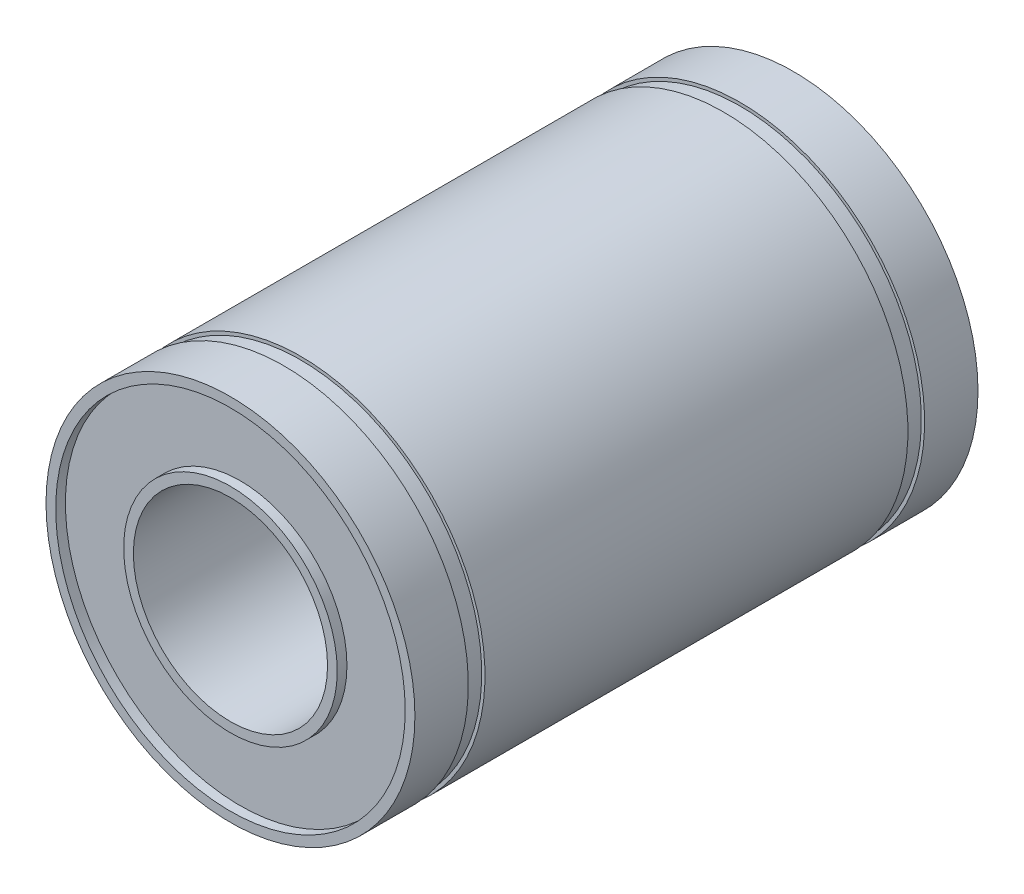
ISO-10303-21;
HEADER;
FILE_DESCRIPTION(('STEP AP214'),'2;1');
FILE_NAME('part.step','',(''),(''),'','','');
FILE_SCHEMA(('AUTOMOTIVE_DESIGN { 1 0 10303 214 1 1 1 1 }'));
ENDSEC;
DATA;
#1=APPLICATION_CONTEXT('core data for automotive mechanical design processes');
#2=APPLICATION_PROTOCOL_DEFINITION('international standard','automotive_design',2000,#1);
#3=PRODUCT_CONTEXT('',#1,'mechanical');
#4=PRODUCT('Part','Part','',(#3));
#5=PRODUCT_RELATED_PRODUCT_CATEGORY('part','',(#4));
#6=PRODUCT_DEFINITION_FORMATION('','',#4);
#7=PRODUCT_DEFINITION_CONTEXT('part definition',#1,'design');
#8=PRODUCT_DEFINITION('design','',#6,#7);
#9=PRODUCT_DEFINITION_SHAPE('','',#8);
#10=(LENGTH_UNIT() NAMED_UNIT(*) SI_UNIT(.MILLI.,.METRE.));
#11=(NAMED_UNIT(*) PLANE_ANGLE_UNIT() SI_UNIT($,.RADIAN.));
#12=(NAMED_UNIT(*) SI_UNIT($,.STERADIAN.) SOLID_ANGLE_UNIT());
#13=UNCERTAINTY_MEASURE_WITH_UNIT(LENGTH_MEASURE(1.E-05),#10,'distance_accuracy_value','');
#14=(GEOMETRIC_REPRESENTATION_CONTEXT(3) GLOBAL_UNCERTAINTY_ASSIGNED_CONTEXT((#13)) GLOBAL_UNIT_ASSIGNED_CONTEXT((#10,
#11,#12)) REPRESENTATION_CONTEXT('',''));
#15=CARTESIAN_POINT('',(0.,0.,0.));
#16=DIRECTION('',(0.,0.,1.));
#17=DIRECTION('',(1.,0.,0.));
#18=AXIS2_PLACEMENT_3D('',#15,#16,#17);
#19=CARTESIAN_POINT('',(0.,0.,-14.5));
#20=DIRECTION('',(0.,0.,1.));
#21=DIRECTION('',(1.,0.,0.));
#22=AXIS2_PLACEMENT_3D('',#19,#20,#21);
#23=PLANE('',#22);
#24=CARTESIAN_POINT('',(0.,0.,-14.5));
#25=DIRECTION('',(0.,0.,1.));
#26=DIRECTION('',(1.,0.,0.));
#27=AXIS2_PLACEMENT_3D('',#24,#25,#26);
#28=CIRCLE('',#27,5.);
#29=CARTESIAN_POINT('',(5.,0.,-14.5));
#30=VERTEX_POINT('',#29);
#31=EDGE_CURVE('E45',#30,#30,#28,.T.);
#32=ORIENTED_EDGE('',*,*,#31,.T.);
#33=EDGE_LOOP('',(#32));
#34=FACE_BOUND('',#33,.T.);
#35=CARTESIAN_POINT('',(0.,0.,-14.5));
#36=DIRECTION('',(0.,0.,1.));
#37=DIRECTION('',(1.,0.,0.));
#38=AXIS2_PLACEMENT_3D('',#35,#36,#37);
#39=CIRCLE('',#38,5.5);
#40=CARTESIAN_POINT('',(5.5,0.,-14.5));
#41=VERTEX_POINT('',#40);
#42=EDGE_CURVE('E91',#41,#41,#39,.T.);
#43=ORIENTED_EDGE('',*,*,#42,.F.);
#44=EDGE_LOOP('',(#43));
#45=FACE_BOUND('',#44,.T.);
#46=ADVANCED_FACE('F32',(#34,#45),#23,.F.);
#47=CARTESIAN_POINT('',(0.,0.,14.5));
#48=DIRECTION('',(0.,0.,1.));
#49=DIRECTION('',(1.,0.,0.));
#50=AXIS2_PLACEMENT_3D('',#47,#48,#49);
#51=PLANE('',#50);
#52=CARTESIAN_POINT('',(0.,0.,14.5));
#53=DIRECTION('',(0.,0.,1.));
#54=DIRECTION('',(1.,0.,0.));
#55=AXIS2_PLACEMENT_3D('',#52,#53,#54);
#56=CIRCLE('',#55,5.);
#57=CARTESIAN_POINT('',(5.,0.,14.5));
#58=VERTEX_POINT('',#57);
#59=EDGE_CURVE('E43',#58,#58,#56,.T.);
#60=ORIENTED_EDGE('',*,*,#59,.F.);
#61=EDGE_LOOP('',(#60));
#62=FACE_BOUND('',#61,.T.);
#63=CARTESIAN_POINT('',(0.,0.,14.5));
#64=DIRECTION('',(0.,0.,1.));
#65=DIRECTION('',(1.,0.,0.));
#66=AXIS2_PLACEMENT_3D('',#63,#64,#65);
#67=CIRCLE('',#66,5.5);
#68=CARTESIAN_POINT('',(5.5,0.,14.5));
#69=VERTEX_POINT('',#68);
#70=EDGE_CURVE('E79',#69,#69,#67,.T.);
#71=ORIENTED_EDGE('',*,*,#70,.T.);
#72=EDGE_LOOP('',(#71));
#73=FACE_BOUND('',#72,.T.);
#74=ADVANCED_FACE('F111',(#62,#73),#51,.T.);
#75=CARTESIAN_POINT('',(0.,0.,14.5));
#76=DIRECTION('',(0.,0.,-1.));
#77=DIRECTION('',(-1.,0.,0.));
#78=AXIS2_PLACEMENT_3D('',#75,#76,#77);
#79=CYLINDRICAL_SURFACE('',#78,9.5);
#80=CARTESIAN_POINT('',(0.,0.,-14.5));
#81=DIRECTION('',(0.,0.,1.));
#82=DIRECTION('',(1.,0.,0.));
#83=AXIS2_PLACEMENT_3D('',#80,#81,#82);
#84=CIRCLE('',#83,9.5);
#85=CARTESIAN_POINT('',(9.5,0.,-14.5));
#86=VERTEX_POINT('',#85);
#87=EDGE_CURVE('E36',#86,#86,#84,.T.);
#88=ORIENTED_EDGE('',*,*,#87,.T.);
#89=EDGE_LOOP('',(#88));
#90=FACE_BOUND('',#89,.T.);
#91=CARTESIAN_POINT('',(0.,0.,-11.75));
#92=DIRECTION('',(0.,0.,-1.));
#93=DIRECTION('',(-1.,0.,0.));
#94=AXIS2_PLACEMENT_3D('',#91,#92,#93);
#95=CIRCLE('',#94,9.5);
#96=CARTESIAN_POINT('',(-9.5,0.,-11.75));
#97=VERTEX_POINT('',#96);
#98=EDGE_CURVE('E71',#97,#97,#95,.T.);
#99=ORIENTED_EDGE('',*,*,#98,.T.);
#100=EDGE_LOOP('',(#99));
#101=FACE_BOUND('',#100,.T.);
#102=ADVANCED_FACE('F34',(#90,#101),#79,.T.);
#103=CARTESIAN_POINT('',(0.,0.,10.8916442658275));
#104=DIRECTION('',(0.,0.,-1.));
#105=DIRECTION('',(-1.,0.,0.));
#106=AXIS2_PLACEMENT_3D('',#103,#104,#105);
#107=CIRCLE('',#106,9.5);
#108=CARTESIAN_POINT('',(-9.5,0.,10.8916442658275));
#109=VERTEX_POINT('',#108);
#110=EDGE_CURVE('E53',#109,#109,#107,.T.);
#111=ORIENTED_EDGE('',*,*,#110,.T.);
#112=EDGE_LOOP('',(#111));
#113=FACE_BOUND('',#112,.T.);
#114=CARTESIAN_POINT('',(0.,0.,-10.8916442658275));
#115=DIRECTION('',(0.,0.,-1.));
#116=DIRECTION('',(-1.,0.,0.));
#117=AXIS2_PLACEMENT_3D('',#114,#115,#116);
#118=CIRCLE('',#117,9.5);
#119=CARTESIAN_POINT('',(-9.5,0.,-10.8916442658275));
#120=VERTEX_POINT('',#119);
#121=EDGE_CURVE('E62',#120,#120,#118,.T.);
#122=ORIENTED_EDGE('',*,*,#121,.F.);
#123=EDGE_LOOP('',(#122));
#124=FACE_BOUND('',#123,.T.);
#125=ADVANCED_FACE('F138',(#113,#124),#79,.T.);
#126=CARTESIAN_POINT('',(0.,0.,11.75));
#127=DIRECTION('',(0.,0.,-1.));
#128=DIRECTION('',(-1.,0.,0.));
#129=AXIS2_PLACEMENT_3D('',#126,#127,#128);
#130=CIRCLE('',#129,9.5);
#131=CARTESIAN_POINT('',(-9.5,0.,11.75));
#132=VERTEX_POINT('',#131);
#133=EDGE_CURVE('E48',#132,#132,#130,.T.);
#134=ORIENTED_EDGE('',*,*,#133,.F.);
#135=EDGE_LOOP('',(#134));
#136=FACE_BOUND('',#135,.T.);
#137=CARTESIAN_POINT('',(0.,0.,14.5));
#138=DIRECTION('',(0.,0.,1.));
#139=DIRECTION('',(1.,0.,0.));
#140=AXIS2_PLACEMENT_3D('',#137,#138,#139);
#141=CIRCLE('',#140,9.5);
#142=CARTESIAN_POINT('',(9.5,0.,14.5));
#143=VERTEX_POINT('',#142);
#144=EDGE_CURVE('E10',#143,#143,#141,.T.);
#145=ORIENTED_EDGE('',*,*,#144,.F.);
#146=EDGE_LOOP('',(#145));
#147=FACE_BOUND('',#146,.T.);
#148=ADVANCED_FACE('F130',(#136,#147),#79,.T.);
#149=CARTESIAN_POINT('',(0.,0.,14.5));
#150=DIRECTION('',(0.,0.,1.));
#151=DIRECTION('',(1.,0.,0.));
#152=AXIS2_PLACEMENT_3D('',#149,#150,#151);
#153=CIRCLE('',#152,9.);
#154=CARTESIAN_POINT('',(9.,0.,14.5));
#155=VERTEX_POINT('',#154);
#156=EDGE_CURVE('E75',#155,#155,#153,.T.);
#157=ORIENTED_EDGE('',*,*,#156,.F.);
#158=EDGE_LOOP('',(#157));
#159=FACE_BOUND('',#158,.T.);
#160=ORIENTED_EDGE('',*,*,#144,.T.);
#161=EDGE_LOOP('',(#160));
#162=FACE_BOUND('',#161,.T.);
#163=ADVANCED_FACE('F119',(#159,#162),#51,.T.);
#164=CARTESIAN_POINT('',(0.,0.,-14.5));
#165=DIRECTION('',(0.,0.,1.));
#166=DIRECTION('',(1.,0.,0.));
#167=AXIS2_PLACEMENT_3D('',#164,#165,#166);
#168=CIRCLE('',#167,9.);
#169=CARTESIAN_POINT('',(9.,0.,-14.5));
#170=VERTEX_POINT('',#169);
#171=EDGE_CURVE('E87',#170,#170,#168,.T.);
#172=ORIENTED_EDGE('',*,*,#171,.T.);
#173=EDGE_LOOP('',(#172));
#174=FACE_BOUND('',#173,.T.);
#175=ORIENTED_EDGE('',*,*,#87,.F.);
#176=EDGE_LOOP('',(#175));
#177=FACE_BOUND('',#176,.T.);
#178=ADVANCED_FACE('F113',(#174,#177),#23,.F.);
#179=CARTESIAN_POINT('',(0.,0.,14.5));
#180=DIRECTION('',(0.,0.,-1.));
#181=DIRECTION('',(-1.,0.,0.));
#182=AXIS2_PLACEMENT_3D('',#179,#180,#181);
#183=CYLINDRICAL_SURFACE('',#182,5.);
#184=ORIENTED_EDGE('',*,*,#59,.T.);
#185=EDGE_LOOP('',(#184));
#186=FACE_BOUND('',#185,.T.);
#187=ORIENTED_EDGE('',*,*,#31,.F.);
#188=EDGE_LOOP('',(#187));
#189=FACE_BOUND('',#188,.T.);
#190=ADVANCED_FACE('F121',(#186,#189),#183,.F.);
#191=CARTESIAN_POINT('',(0.,0.,11.75));
#192=DIRECTION('',(0.,0.,1.));
#193=DIRECTION('',(1.,0.,0.));
#194=AXIS2_PLACEMENT_3D('',#191,#192,#193);
#195=PLANE('',#194);
#196=CARTESIAN_POINT('',(0.,0.,11.75));
#197=DIRECTION('',(0.,0.,-1.));
#198=DIRECTION('',(-1.,0.,0.));
#199=AXIS2_PLACEMENT_3D('',#196,#197,#198);
#200=CIRCLE('',#199,9.33276036614611);
#201=CARTESIAN_POINT('',(-9.33276036614611,0.,11.75));
#202=VERTEX_POINT('',#201);
#203=EDGE_CURVE('E59',#202,#202,#200,.T.);
#204=ORIENTED_EDGE('',*,*,#203,.F.);
#205=EDGE_LOOP('',(#204));
#206=FACE_BOUND('',#205,.T.);
#207=ORIENTED_EDGE('',*,*,#133,.T.);
#208=EDGE_LOOP('',(#207));
#209=FACE_BOUND('',#208,.T.);
#210=ADVANCED_FACE('F127',(#206,#209),#195,.F.);
#211=CARTESIAN_POINT('',(0.,0.,10.8916442658275));
#212=DIRECTION('',(0.,0.,-1.));
#213=DIRECTION('',(-1.,0.,0.));
#214=AXIS2_PLACEMENT_3D('',#211,#212,#213);
#215=PLANE('',#214);
#216=ORIENTED_EDGE('',*,*,#110,.F.);
#217=EDGE_LOOP('',(#216));
#218=FACE_BOUND('',#217,.T.);
#219=CARTESIAN_POINT('',(0.,0.,10.8916442658275));
#220=DIRECTION('',(0.,0.,-1.));
#221=DIRECTION('',(-1.,0.,0.));
#222=AXIS2_PLACEMENT_3D('',#219,#220,#221);
#223=CIRCLE('',#222,9.33276036614611);
#224=CARTESIAN_POINT('',(-9.33276036614611,0.,10.8916442658275));
#225=VERTEX_POINT('',#224);
#226=EDGE_CURVE('E56',#225,#225,#223,.T.);
#227=ORIENTED_EDGE('',*,*,#226,.T.);
#228=EDGE_LOOP('',(#227));
#229=FACE_BOUND('',#228,.T.);
#230=ADVANCED_FACE('F154',(#218,#229),#215,.F.);
#231=CARTESIAN_POINT('',(0.,0.,0.));
#232=DIRECTION('',(0.,0.,-1.));
#233=DIRECTION('',(-1.,0.,0.));
#234=AXIS2_PLACEMENT_3D('',#231,#232,#233);
#235=CYLINDRICAL_SURFACE('',#234,9.33276036614611);
#236=ORIENTED_EDGE('',*,*,#226,.F.);
#237=EDGE_LOOP('',(#236));
#238=FACE_BOUND('',#237,.T.);
#239=ORIENTED_EDGE('',*,*,#203,.T.);
#240=EDGE_LOOP('',(#239));
#241=FACE_BOUND('',#240,.T.);
#242=ADVANCED_FACE('F144',(#238,#241),#235,.T.);
#243=CARTESIAN_POINT('',(9.5,0.,-11.75));
#244=DIRECTION('',(0.,0.,1.));
#245=DIRECTION('',(1.,0.,0.));
#246=AXIS2_PLACEMENT_3D('',#243,#244,#245);
#247=PLANE('',#246);
#248=CARTESIAN_POINT('',(0.,0.,-11.75));
#249=DIRECTION('',(0.,0.,-1.));
#250=DIRECTION('',(-1.,0.,0.));
#251=AXIS2_PLACEMENT_3D('',#248,#249,#250);
#252=CIRCLE('',#251,9.33276036614611);
#253=CARTESIAN_POINT('',(-9.33276036614611,0.,-11.75));
#254=VERTEX_POINT('',#253);
#255=EDGE_CURVE('E68',#254,#254,#252,.T.);
#256=ORIENTED_EDGE('',*,*,#255,.T.);
#257=EDGE_LOOP('',(#256));
#258=FACE_BOUND('',#257,.T.);
#259=ORIENTED_EDGE('',*,*,#98,.F.);
#260=EDGE_LOOP('',(#259));
#261=FACE_BOUND('',#260,.T.);
#262=ADVANCED_FACE('F141',(#258,#261),#247,.T.);
#263=CARTESIAN_POINT('',(0.,0.,0.));
#264=DIRECTION('',(0.,0.,-1.));
#265=DIRECTION('',(-1.,0.,0.));
#266=AXIS2_PLACEMENT_3D('',#263,#264,#265);
#267=CYLINDRICAL_SURFACE('',#266,9.33276036614611);
#268=CARTESIAN_POINT('',(0.,0.,-10.8916442658275));
#269=DIRECTION('',(0.,0.,-1.));
#270=DIRECTION('',(-1.,0.,0.));
#271=AXIS2_PLACEMENT_3D('',#268,#269,#270);
#272=CIRCLE('',#271,9.33276036614611);
#273=CARTESIAN_POINT('',(-9.33276036614611,0.,-10.8916442658275));
#274=VERTEX_POINT('',#273);
#275=EDGE_CURVE('E65',#274,#274,#272,.T.);
#276=ORIENTED_EDGE('',*,*,#275,.T.);
#277=EDGE_LOOP('',(#276));
#278=FACE_BOUND('',#277,.T.);
#279=ORIENTED_EDGE('',*,*,#255,.F.);
#280=EDGE_LOOP('',(#279));
#281=FACE_BOUND('',#280,.T.);
#282=ADVANCED_FACE('F143',(#278,#281),#267,.T.);
#283=CARTESIAN_POINT('',(9.33276036614611,0.,-10.8916442658275));
#284=DIRECTION('',(0.,0.,-1.));
#285=DIRECTION('',(-1.,0.,0.));
#286=AXIS2_PLACEMENT_3D('',#283,#284,#285);
#287=PLANE('',#286);
#288=ORIENTED_EDGE('',*,*,#121,.T.);
#289=EDGE_LOOP('',(#288));
#290=FACE_BOUND('',#289,.T.);
#291=ORIENTED_EDGE('',*,*,#275,.F.);
#292=EDGE_LOOP('',(#291));
#293=FACE_BOUND('',#292,.T.);
#294=ADVANCED_FACE('F151',(#290,#293),#287,.T.);
#295=CARTESIAN_POINT('',(0.,0.,14.));
#296=DIRECTION('',(0.,0.,1.));
#297=DIRECTION('',(1.,0.,0.));
#298=AXIS2_PLACEMENT_3D('',#295,#296,#297);
#299=CYLINDRICAL_SURFACE('',#298,5.5);
#300=CARTESIAN_POINT('',(0.,0.,14.));
#301=DIRECTION('',(0.,0.,1.));
#302=DIRECTION('',(1.,0.,0.));
#303=AXIS2_PLACEMENT_3D('',#300,#301,#302);
#304=CIRCLE('',#303,5.5);
#305=CARTESIAN_POINT('',(5.5,0.,14.));
#306=VERTEX_POINT('',#305);
#307=EDGE_CURVE('E78',#306,#306,#304,.T.);
#308=ORIENTED_EDGE('',*,*,#307,.T.);
#309=EDGE_LOOP('',(#308));
#310=FACE_BOUND('',#309,.T.);
#311=ORIENTED_EDGE('',*,*,#70,.F.);
#312=EDGE_LOOP('',(#311));
#313=FACE_BOUND('',#312,.T.);
#314=ADVANCED_FACE('F158',(#310,#313),#299,.T.);
#315=CARTESIAN_POINT('',(0.,0.,14.));
#316=DIRECTION('',(0.,0.,1.));
#317=DIRECTION('',(1.,0.,0.));
#318=AXIS2_PLACEMENT_3D('',#315,#316,#317);
#319=CYLINDRICAL_SURFACE('',#318,9.);
#320=CARTESIAN_POINT('',(0.,0.,14.));
#321=DIRECTION('',(0.,0.,1.));
#322=DIRECTION('',(1.,0.,0.));
#323=AXIS2_PLACEMENT_3D('',#320,#321,#322);
#324=CIRCLE('',#323,9.);
#325=CARTESIAN_POINT('',(9.,0.,14.));
#326=VERTEX_POINT('',#325);
#327=EDGE_CURVE('E74',#326,#326,#324,.T.);
#328=ORIENTED_EDGE('',*,*,#327,.F.);
#329=EDGE_LOOP('',(#328));
#330=FACE_BOUND('',#329,.T.);
#331=ORIENTED_EDGE('',*,*,#156,.T.);
#332=EDGE_LOOP('',(#331));
#333=FACE_BOUND('',#332,.T.);
#334=ADVANCED_FACE('F229',(#330,#333),#319,.F.);
#335=CARTESIAN_POINT('',(0.,0.,14.));
#336=DIRECTION('',(0.,0.,1.));
#337=DIRECTION('',(1.,0.,0.));
#338=AXIS2_PLACEMENT_3D('',#335,#336,#337);
#339=PLANE('',#338);
#340=ORIENTED_EDGE('',*,*,#307,.F.);
#341=EDGE_LOOP('',(#340));
#342=FACE_BOUND('',#341,.T.);
#343=ORIENTED_EDGE('',*,*,#327,.T.);
#344=EDGE_LOOP('',(#343));
#345=FACE_BOUND('',#344,.T.);
#346=ADVANCED_FACE('F106',(#342,#345),#339,.T.);
#347=CARTESIAN_POINT('',(0.,0.,-14.));
#348=DIRECTION('',(0.,0.,-1.));
#349=DIRECTION('',(-1.,0.,0.));
#350=AXIS2_PLACEMENT_3D('',#347,#348,#349);
#351=CYLINDRICAL_SURFACE('',#350,5.5);
#352=CARTESIAN_POINT('',(0.,0.,-14.));
#353=DIRECTION('',(0.,0.,1.));
#354=DIRECTION('',(1.,0.,0.));
#355=AXIS2_PLACEMENT_3D('',#352,#353,#354);
#356=CIRCLE('',#355,5.5);
#357=CARTESIAN_POINT('',(5.5,0.,-14.));
#358=VERTEX_POINT('',#357);
#359=EDGE_CURVE('E90',#358,#358,#356,.T.);
#360=ORIENTED_EDGE('',*,*,#359,.F.);
#361=EDGE_LOOP('',(#360));
#362=FACE_BOUND('',#361,.T.);
#363=ORIENTED_EDGE('',*,*,#42,.T.);
#364=EDGE_LOOP('',(#363));
#365=FACE_BOUND('',#364,.T.);
#366=ADVANCED_FACE('F102',(#362,#365),#351,.T.);
#367=CARTESIAN_POINT('',(0.,0.,-14.));
#368=DIRECTION('',(0.,0.,-1.));
#369=DIRECTION('',(-1.,0.,0.));
#370=AXIS2_PLACEMENT_3D('',#367,#368,#369);
#371=CYLINDRICAL_SURFACE('',#370,9.);
#372=CARTESIAN_POINT('',(0.,0.,-14.));
#373=DIRECTION('',(0.,0.,1.));
#374=DIRECTION('',(1.,0.,0.));
#375=AXIS2_PLACEMENT_3D('',#372,#373,#374);
#376=CIRCLE('',#375,9.);
#377=CARTESIAN_POINT('',(9.,0.,-14.));
#378=VERTEX_POINT('',#377);
#379=EDGE_CURVE('E82',#378,#378,#376,.T.);
#380=ORIENTED_EDGE('',*,*,#379,.T.);
#381=EDGE_LOOP('',(#380));
#382=FACE_BOUND('',#381,.T.);
#383=ORIENTED_EDGE('',*,*,#171,.F.);
#384=EDGE_LOOP('',(#383));
#385=FACE_BOUND('',#384,.T.);
#386=ADVANCED_FACE('F105',(#382,#385),#371,.F.);
#387=CARTESIAN_POINT('',(0.,0.,-14.));
#388=DIRECTION('',(0.,0.,-1.));
#389=DIRECTION('',(1.,0.,0.));
#390=AXIS2_PLACEMENT_3D('',#387,#388,#389);
#391=PLANE('',#390);
#392=ORIENTED_EDGE('',*,*,#359,.T.);
#393=EDGE_LOOP('',(#392));
#394=FACE_BOUND('',#393,.T.);
#395=ORIENTED_EDGE('',*,*,#379,.F.);
#396=EDGE_LOOP('',(#395));
#397=FACE_BOUND('',#396,.T.);
#398=ADVANCED_FACE('F99',(#394,#397),#391,.T.);
#399=CLOSED_SHELL('',(#46,#74,#102,#125,#148,#163,#178,#190,#210,#230,#242,#262,#282,#294,#314,
#334,#346,#366,#386,#398));
#400=MANIFOLD_SOLID_BREP('B2',#399);
#401=ADVANCED_BREP_SHAPE_REPRESENTATION('',(#18,#400),#14);
#402=SHAPE_DEFINITION_REPRESENTATION(#9,#401);
ENDSEC;
END-ISO-10303-21;
